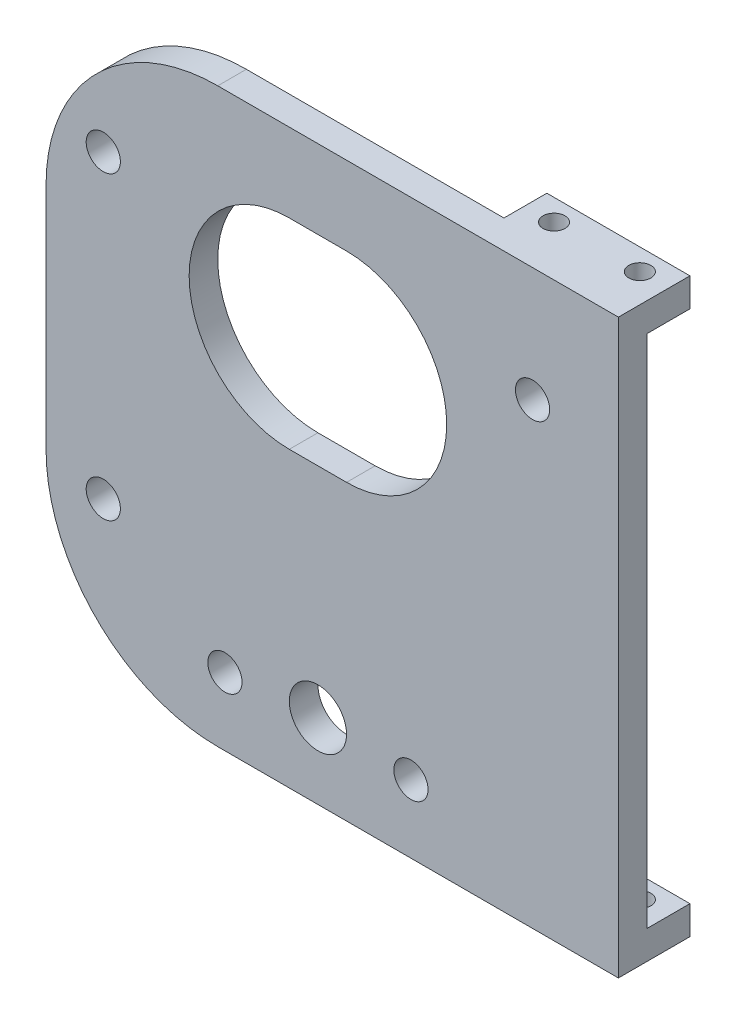
ISO-10303-21;
HEADER;
FILE_DESCRIPTION(('STEP AP214'),'2;1');
FILE_NAME('part.step','',(''),(''),'','','');
FILE_SCHEMA(('AUTOMOTIVE_DESIGN { 1 0 10303 214 1 1 1 1 }'));
ENDSEC;
DATA;
#1=APPLICATION_CONTEXT('core data for automotive mechanical design processes');
#2=APPLICATION_PROTOCOL_DEFINITION('international standard','automotive_design',2000,#1);
#3=PRODUCT_CONTEXT('',#1,'mechanical');
#4=PRODUCT('Part','Part','',(#3));
#5=PRODUCT_RELATED_PRODUCT_CATEGORY('part','',(#4));
#6=PRODUCT_DEFINITION_FORMATION('','',#4);
#7=PRODUCT_DEFINITION_CONTEXT('part definition',#1,'design');
#8=PRODUCT_DEFINITION('design','',#6,#7);
#9=PRODUCT_DEFINITION_SHAPE('','',#8);
#10=(LENGTH_UNIT() NAMED_UNIT(*) SI_UNIT(.MILLI.,.METRE.));
#11=(NAMED_UNIT(*) PLANE_ANGLE_UNIT() SI_UNIT($,.RADIAN.));
#12=(NAMED_UNIT(*) SI_UNIT($,.STERADIAN.) SOLID_ANGLE_UNIT());
#13=UNCERTAINTY_MEASURE_WITH_UNIT(LENGTH_MEASURE(1.E-05),#10,'distance_accuracy_value','');
#14=(GEOMETRIC_REPRESENTATION_CONTEXT(3) GLOBAL_UNCERTAINTY_ASSIGNED_CONTEXT((#13)) GLOBAL_UNIT_ASSIGNED_CONTEXT((#10,
#11,#12)) REPRESENTATION_CONTEXT('',''));
#15=CARTESIAN_POINT('',(0.,0.,0.));
#16=DIRECTION('',(0.,0.,1.));
#17=DIRECTION('',(1.,0.,0.));
#18=AXIS2_PLACEMENT_3D('',#15,#16,#17);
#19=CARTESIAN_POINT('',(0.,0.,0.));
#20=DIRECTION('',(0.,0.,1.));
#21=DIRECTION('',(1.,0.,0.));
#22=AXIS2_PLACEMENT_3D('',#19,#20,#21);
#23=PLANE('',#22);
#24=DIRECTION('',(1.,0.,0.));
#25=VECTOR('',#24,1.);
#26=CARTESIAN_POINT('',(-4.76249999999997,23.01875,0.));
#27=LINE('',#26,#25);
#28=CARTESIAN_POINT('',(-4.76249999999997,23.01875,0.));
#29=VERTEX_POINT('',#28);
#30=CARTESIAN_POINT('',(1.58750000000004,23.01875,0.));
#31=VERTEX_POINT('',#30);
#32=EDGE_CURVE('E165',#29,#31,#27,.T.);
#33=ORIENTED_EDGE('',*,*,#32,.F.);
#34=CARTESIAN_POINT('',(-4.76249999999997,11.90625,0.));
#35=DIRECTION('',(0.,0.,1.));
#36=DIRECTION('',(1.,0.,0.));
#37=AXIS2_PLACEMENT_3D('',#34,#35,#36);
#38=CIRCLE('',#37,11.1125);
#39=CARTESIAN_POINT('',(-4.76249999999997,0.79375000000001,0.));
#40=VERTEX_POINT('',#39);
#41=EDGE_CURVE('E148',#40,#29,#38,.F.);
#42=ORIENTED_EDGE('',*,*,#41,.F.);
#43=DIRECTION('',(-1.,0.,0.));
#44=VECTOR('',#43,1.);
#45=CARTESIAN_POINT('',(-4.76249999999997,0.79375000000001,0.));
#46=LINE('',#45,#44);
#47=CARTESIAN_POINT('',(1.58750000000004,0.79375000000001,0.));
#48=VERTEX_POINT('',#47);
#49=EDGE_CURVE('E157',#48,#40,#46,.T.);
#50=ORIENTED_EDGE('',*,*,#49,.F.);
#51=CARTESIAN_POINT('',(1.58750000000004,11.90625,0.));
#52=DIRECTION('',(0.,0.,1.));
#53=DIRECTION('',(1.,0.,0.));
#54=AXIS2_PLACEMENT_3D('',#51,#52,#53);
#55=CIRCLE('',#54,11.1125);
#56=EDGE_CURVE('E49',#31,#48,#55,.F.);
#57=ORIENTED_EDGE('',*,*,#56,.F.);
#58=EDGE_LOOP('',(#33,#42,#50,#57));
#59=FACE_BOUND('',#58,.T.);
#60=CARTESIAN_POINT('',(-1.58749999999996,-23.4156250000001,0.));
#61=DIRECTION('',(0.,0.,1.));
#62=DIRECTION('',(1.,0.,0.));
#63=AXIS2_PLACEMENT_3D('',#60,#61,#62);
#64=CIRCLE('',#63,3.175);
#65=CARTESIAN_POINT('',(1.58750000000004,-23.4156250000001,0.));
#66=VERTEX_POINT('',#65);
#67=EDGE_CURVE('E185',#66,#66,#64,.F.);
#68=ORIENTED_EDGE('',*,*,#67,.F.);
#69=EDGE_LOOP('',(#68));
#70=FACE_BOUND('',#69,.T.);
#71=CARTESIAN_POINT('',(-11.9062499999999,-24.2093750000001,0.));
#72=DIRECTION('',(0.,0.,1.));
#73=DIRECTION('',(1.,0.,0.));
#74=AXIS2_PLACEMENT_3D('',#71,#72,#73);
#75=CIRCLE('',#74,3.175);
#76=CARTESIAN_POINT('',(-8.73124999999989,-24.2093750000001,0.));
#77=VERTEX_POINT('',#76);
#78=EDGE_CURVE('E217',#77,#77,#75,.T.);
#79=ORIENTED_EDGE('',*,*,#78,.T.);
#80=EDGE_LOOP('',(#79));
#81=FACE_BOUND('',#80,.T.);
#82=CARTESIAN_POINT('',(8.73125000000012,-24.209375,0.));
#83=DIRECTION('',(0.,0.,1.));
#84=DIRECTION('',(1.,0.,0.));
#85=AXIS2_PLACEMENT_3D('',#82,#83,#84);
#86=CIRCLE('',#85,3.175);
#87=CARTESIAN_POINT('',(11.9062500000001,-24.209375,0.));
#88=VERTEX_POINT('',#87);
#89=EDGE_CURVE('E221',#88,#88,#86,.T.);
#90=ORIENTED_EDGE('',*,*,#89,.T.);
#91=EDGE_LOOP('',(#90));
#92=FACE_BOUND('',#91,.T.);
#93=CARTESIAN_POINT('',(22.225,19.05,0.));
#94=DIRECTION('',(0.,0.,1.));
#95=DIRECTION('',(1.,0.,0.));
#96=AXIS2_PLACEMENT_3D('',#93,#94,#95);
#97=CIRCLE('',#96,3.175);
#98=CARTESIAN_POINT('',(25.4,19.05,0.));
#99=VERTEX_POINT('',#98);
#100=EDGE_CURVE('E227',#99,#99,#97,.T.);
#101=ORIENTED_EDGE('',*,*,#100,.T.);
#102=EDGE_LOOP('',(#101));
#103=FACE_BOUND('',#102,.T.);
#104=CARTESIAN_POINT('',(-25.3999999999999,-14.2875000000001,0.));
#105=DIRECTION('',(0.,0.,1.));
#106=DIRECTION('',(1.,0.,0.));
#107=AXIS2_PLACEMENT_3D('',#104,#105,#106);
#108=CIRCLE('',#107,3.175);
#109=CARTESIAN_POINT('',(-22.2249999999999,-14.2875000000001,0.));
#110=VERTEX_POINT('',#109);
#111=EDGE_CURVE('E233',#110,#110,#108,.T.);
#112=ORIENTED_EDGE('',*,*,#111,.T.);
#113=EDGE_LOOP('',(#112));
#114=FACE_BOUND('',#113,.T.);
#115=CARTESIAN_POINT('',(-25.4,19.0499999999999,0.));
#116=DIRECTION('',(0.,0.,1.));
#117=DIRECTION('',(1.,0.,0.));
#118=AXIS2_PLACEMENT_3D('',#115,#116,#117);
#119=CIRCLE('',#118,3.175);
#120=CARTESIAN_POINT('',(-22.225,19.0499999999999,0.));
#121=VERTEX_POINT('',#120);
#122=EDGE_CURVE('E239',#121,#121,#119,.T.);
#123=ORIENTED_EDGE('',*,*,#122,.T.);
#124=EDGE_LOOP('',(#123));
#125=FACE_BOUND('',#124,.T.);
#126=DIRECTION('',(-1.,0.,0.));
#127=VECTOR('',#126,1.);
#128=CARTESIAN_POINT('',(31.75,28.575,0.));
#129=LINE('',#128,#127);
#130=CARTESIAN_POINT('',(31.75,28.575,0.));
#131=VERTEX_POINT('',#130);
#132=CARTESIAN_POINT('',(15.875,28.575,0.));
#133=VERTEX_POINT('',#132);
#134=EDGE_CURVE('E259',#131,#133,#129,.T.);
#135=ORIENTED_EDGE('',*,*,#134,.F.);
#136=DIRECTION('',(0.,1.,0.));
#137=VECTOR('',#136,1.);
#138=CARTESIAN_POINT('',(31.75,31.75,0.));
#139=LINE('',#138,#137);
#140=CARTESIAN_POINT('',(31.75,-28.575,0.));
#141=VERTEX_POINT('',#140);
#142=EDGE_CURVE('E318',#141,#131,#139,.T.);
#143=ORIENTED_EDGE('',*,*,#142,.F.);
#144=DIRECTION('',(1.,0.,0.));
#145=VECTOR('',#144,1.);
#146=CARTESIAN_POINT('',(31.75,-28.575,0.));
#147=LINE('',#146,#145);
#148=CARTESIAN_POINT('',(15.875,-28.575,0.));
#149=VERTEX_POINT('',#148);
#150=EDGE_CURVE('E298',#149,#141,#147,.T.);
#151=ORIENTED_EDGE('',*,*,#150,.F.);
#152=DIRECTION('',(0.,1.,0.));
#153=VECTOR('',#152,1.);
#154=CARTESIAN_POINT('',(15.875,-31.75,0.));
#155=LINE('',#154,#153);
#156=CARTESIAN_POINT('',(15.875,-31.75,0.));
#157=VERTEX_POINT('',#156);
#158=EDGE_CURVE('E293',#157,#149,#155,.T.);
#159=ORIENTED_EDGE('',*,*,#158,.F.);
#160=DIRECTION('',(1.,0.,0.));
#161=VECTOR('',#160,1.);
#162=CARTESIAN_POINT('',(-31.75,-31.75,0.));
#163=LINE('',#162,#161);
#164=CARTESIAN_POINT('',(-12.7,-31.75,0.));
#165=VERTEX_POINT('',#164);
#166=EDGE_CURVE('E323',#165,#157,#163,.T.);
#167=ORIENTED_EDGE('',*,*,#166,.F.);
#168=CARTESIAN_POINT('',(-12.7,-12.7,0.));
#169=DIRECTION('',(0.,0.,1.));
#170=DIRECTION('',(1.,0.,0.));
#171=AXIS2_PLACEMENT_3D('',#168,#169,#170);
#172=CIRCLE('',#171,19.05);
#173=CARTESIAN_POINT('',(-31.75,-12.7,0.));
#174=VERTEX_POINT('',#173);
#175=EDGE_CURVE('E349',#165,#174,#172,.F.);
#176=ORIENTED_EDGE('',*,*,#175,.T.);
#177=DIRECTION('',(0.,-1.,0.));
#178=VECTOR('',#177,1.);
#179=CARTESIAN_POINT('',(-31.75,31.75,0.));
#180=LINE('',#179,#178);
#181=CARTESIAN_POINT('',(-31.75,12.7,0.));
#182=VERTEX_POINT('',#181);
#183=EDGE_CURVE('E336',#182,#174,#180,.T.);
#184=ORIENTED_EDGE('',*,*,#183,.F.);
#185=CARTESIAN_POINT('',(-12.7,12.7,0.));
#186=DIRECTION('',(0.,0.,1.));
#187=DIRECTION('',(1.,0.,0.));
#188=AXIS2_PLACEMENT_3D('',#185,#186,#187);
#189=CIRCLE('',#188,19.05);
#190=CARTESIAN_POINT('',(-12.7,31.75,0.));
#191=VERTEX_POINT('',#190);
#192=EDGE_CURVE('E346',#182,#191,#189,.F.);
#193=ORIENTED_EDGE('',*,*,#192,.T.);
#194=DIRECTION('',(-1.,0.,0.));
#195=VECTOR('',#194,1.);
#196=CARTESIAN_POINT('',(-31.75,31.75,0.));
#197=LINE('',#196,#195);
#198=CARTESIAN_POINT('',(15.875,31.75,0.));
#199=VERTEX_POINT('',#198);
#200=EDGE_CURVE('E334',#199,#191,#197,.T.);
#201=ORIENTED_EDGE('',*,*,#200,.F.);
#202=DIRECTION('',(0.,1.,0.));
#203=VECTOR('',#202,1.);
#204=CARTESIAN_POINT('',(15.875,31.75,0.));
#205=LINE('',#204,#203);
#206=EDGE_CURVE('E264',#133,#199,#205,.T.);
#207=ORIENTED_EDGE('',*,*,#206,.F.);
#208=EDGE_LOOP('',(#135,#143,#151,#159,#167,#176,#184,#193,#201,#207));
#209=FACE_BOUND('',#208,.T.);
#210=ADVANCED_FACE('F34',(#59,#70,#81,#92,#103,#114,#125,#209),#23,.F.);
#211=CARTESIAN_POINT('',(31.75,31.75,3.175));
#212=DIRECTION('',(-1.,0.,0.));
#213=DIRECTION('',(0.,0.,1.));
#214=AXIS2_PLACEMENT_3D('',#211,#212,#213);
#215=PLANE('',#214);
#216=DIRECTION('',(0.,0.,-1.));
#217=VECTOR('',#216,1.);
#218=CARTESIAN_POINT('',(31.75,-31.75,3.175));
#219=LINE('',#218,#217);
#220=CARTESIAN_POINT('',(31.75,-31.75,3.175));
#221=VERTEX_POINT('',#220);
#222=CARTESIAN_POINT('',(31.75,-31.75,-4.7625));
#223=VERTEX_POINT('',#222);
#224=EDGE_CURVE('E331',#221,#223,#219,.T.);
#225=ORIENTED_EDGE('',*,*,#224,.T.);
#226=DIRECTION('',(0.,-1.,0.));
#227=VECTOR('',#226,1.);
#228=CARTESIAN_POINT('',(31.75,-31.75,-4.7625));
#229=LINE('',#228,#227);
#230=CARTESIAN_POINT('',(31.75,-28.575,-4.7625));
#231=VERTEX_POINT('',#230);
#232=EDGE_CURVE('E300',#231,#223,#229,.T.);
#233=ORIENTED_EDGE('',*,*,#232,.F.);
#234=DIRECTION('',(0.,0.,1.));
#235=VECTOR('',#234,1.);
#236=CARTESIAN_POINT('',(31.75,-28.575,-4.7625));
#237=LINE('',#236,#235);
#238=EDGE_CURVE('E312',#231,#141,#237,.T.);
#239=ORIENTED_EDGE('',*,*,#238,.T.);
#240=ORIENTED_EDGE('',*,*,#142,.T.);
#241=DIRECTION('',(0.,0.,1.));
#242=VECTOR('',#241,1.);
#243=CARTESIAN_POINT('',(31.75,28.575,-4.7625));
#244=LINE('',#243,#242);
#245=CARTESIAN_POINT('',(31.75,28.575,-4.7625));
#246=VERTEX_POINT('',#245);
#247=EDGE_CURVE('E279',#246,#131,#244,.T.);
#248=ORIENTED_EDGE('',*,*,#247,.F.);
#249=DIRECTION('',(0.,-1.,0.));
#250=VECTOR('',#249,1.);
#251=CARTESIAN_POINT('',(31.75,31.75,-4.7625));
#252=LINE('',#251,#250);
#253=CARTESIAN_POINT('',(31.75,31.75,-4.7625));
#254=VERTEX_POINT('',#253);
#255=EDGE_CURVE('E260',#254,#246,#252,.T.);
#256=ORIENTED_EDGE('',*,*,#255,.F.);
#257=DIRECTION('',(0.,0.,-1.));
#258=VECTOR('',#257,1.);
#259=CARTESIAN_POINT('',(31.75,31.75,3.175));
#260=LINE('',#259,#258);
#261=CARTESIAN_POINT('',(31.75,31.75,3.175));
#262=VERTEX_POINT('',#261);
#263=EDGE_CURVE('E341',#262,#254,#260,.T.);
#264=ORIENTED_EDGE('',*,*,#263,.F.);
#265=DIRECTION('',(0.,1.,0.));
#266=VECTOR('',#265,1.);
#267=CARTESIAN_POINT('',(31.75,31.75,3.175));
#268=LINE('',#267,#266);
#269=EDGE_CURVE('E319',#221,#262,#268,.T.);
#270=ORIENTED_EDGE('',*,*,#269,.F.);
#271=EDGE_LOOP('',(#225,#233,#239,#240,#248,#256,#264,#270));
#272=FACE_BOUND('',#271,.T.);
#273=ADVANCED_FACE('F396',(#272),#215,.F.);
#274=CARTESIAN_POINT('',(-31.75,31.75,3.175));
#275=DIRECTION('',(0.,-1.,0.));
#276=DIRECTION('',(0.,0.,-1.));
#277=AXIS2_PLACEMENT_3D('',#274,#275,#276);
#278=PLANE('',#277);
#279=CARTESIAN_POINT('',(19.05,31.75,-2.38125));
#280=DIRECTION('',(0.,-1.,0.));
#281=DIRECTION('',(0.,0.,-1.));
#282=AXIS2_PLACEMENT_3D('',#279,#280,#281);
#283=CIRCLE('',#282,1.21919999999999);
#284=CARTESIAN_POINT('',(19.05,31.75,-3.60044999999999));
#285=VERTEX_POINT('',#284);
#286=EDGE_CURVE('E250',#285,#285,#283,.T.);
#287=ORIENTED_EDGE('',*,*,#286,.T.);
#288=EDGE_LOOP('',(#287));
#289=FACE_BOUND('',#288,.T.);
#290=CARTESIAN_POINT('',(28.575,31.75,-2.38125));
#291=DIRECTION('',(0.,-1.,0.));
#292=DIRECTION('',(0.,0.,-1.));
#293=AXIS2_PLACEMENT_3D('',#290,#291,#292);
#294=CIRCLE('',#293,1.21919999999999);
#295=CARTESIAN_POINT('',(28.575,31.75,-3.60044999999999));
#296=VERTEX_POINT('',#295);
#297=EDGE_CURVE('E256',#296,#296,#294,.T.);
#298=ORIENTED_EDGE('',*,*,#297,.T.);
#299=EDGE_LOOP('',(#298));
#300=FACE_BOUND('',#299,.T.);
#301=ORIENTED_EDGE('',*,*,#263,.T.);
#302=DIRECTION('',(1.,0.,0.));
#303=VECTOR('',#302,1.);
#304=CARTESIAN_POINT('',(31.75,31.75,-4.7625));
#305=LINE('',#304,#303);
#306=CARTESIAN_POINT('',(15.875,31.75,-4.7625));
#307=VERTEX_POINT('',#306);
#308=EDGE_CURVE('E268',#307,#254,#305,.T.);
#309=ORIENTED_EDGE('',*,*,#308,.F.);
#310=DIRECTION('',(0.,0.,1.));
#311=VECTOR('',#310,1.);
#312=CARTESIAN_POINT('',(15.875,31.75,-4.7625));
#313=LINE('',#312,#311);
#314=EDGE_CURVE('E271',#307,#199,#313,.T.);
#315=ORIENTED_EDGE('',*,*,#314,.T.);
#316=ORIENTED_EDGE('',*,*,#200,.T.);
#317=DIRECTION('',(0.,0.,-1.));
#318=VECTOR('',#317,1.);
#319=CARTESIAN_POINT('',(-12.7,31.75,3.175));
#320=LINE('',#319,#318);
#321=CARTESIAN_POINT('',(-12.7,31.75,3.175));
#322=VERTEX_POINT('',#321);
#323=EDGE_CURVE('E11',#191,#322,#320,.F.);
#324=ORIENTED_EDGE('',*,*,#323,.T.);
#325=DIRECTION('',(-1.,0.,0.));
#326=VECTOR('',#325,1.);
#327=CARTESIAN_POINT('',(-31.75,31.75,3.175));
#328=LINE('',#327,#326);
#329=EDGE_CURVE('E322',#262,#322,#328,.T.);
#330=ORIENTED_EDGE('',*,*,#329,.F.);
#331=EDGE_LOOP('',(#301,#309,#315,#316,#324,#330));
#332=FACE_BOUND('',#331,.T.);
#333=ADVANCED_FACE('F385',(#289,#300,#332),#278,.F.);
#334=CARTESIAN_POINT('',(-31.75,31.75,3.175));
#335=DIRECTION('',(1.,0.,0.));
#336=DIRECTION('',(0.,0.,-1.));
#337=AXIS2_PLACEMENT_3D('',#334,#335,#336);
#338=PLANE('',#337);
#339=ORIENTED_EDGE('',*,*,#183,.T.);
#340=DIRECTION('',(0.,0.,-1.));
#341=VECTOR('',#340,1.);
#342=CARTESIAN_POINT('',(-31.75,-12.7,3.175));
#343=LINE('',#342,#341);
#344=CARTESIAN_POINT('',(-31.75,-12.7,3.175));
#345=VERTEX_POINT('',#344);
#346=EDGE_CURVE('E354',#174,#345,#343,.F.);
#347=ORIENTED_EDGE('',*,*,#346,.T.);
#348=DIRECTION('',(0.,-1.,0.));
#349=VECTOR('',#348,1.);
#350=CARTESIAN_POINT('',(-31.75,31.75,3.175));
#351=LINE('',#350,#349);
#352=CARTESIAN_POINT('',(-31.75,12.7,3.175));
#353=VERTEX_POINT('',#352);
#354=EDGE_CURVE('E326',#353,#345,#351,.T.);
#355=ORIENTED_EDGE('',*,*,#354,.F.);
#356=DIRECTION('',(0.,0.,-1.));
#357=VECTOR('',#356,1.);
#358=CARTESIAN_POINT('',(-31.75,12.7,3.175));
#359=LINE('',#358,#357);
#360=EDGE_CURVE('E351',#353,#182,#359,.T.);
#361=ORIENTED_EDGE('',*,*,#360,.T.);
#362=EDGE_LOOP('',(#339,#347,#355,#361));
#363=FACE_BOUND('',#362,.T.);
#364=ADVANCED_FACE('F377',(#363),#338,.F.);
#365=CARTESIAN_POINT('',(-31.75,-31.75,3.175));
#366=DIRECTION('',(0.,1.,0.));
#367=DIRECTION('',(0.,0.,1.));
#368=AXIS2_PLACEMENT_3D('',#365,#366,#367);
#369=PLANE('',#368);
#370=CARTESIAN_POINT('',(28.575,-31.75,-2.38125));
#371=DIRECTION('',(0.,1.,0.));
#372=DIRECTION('',(0.,0.,1.));
#373=AXIS2_PLACEMENT_3D('',#370,#371,#372);
#374=CIRCLE('',#373,1.21919999999999);
#375=CARTESIAN_POINT('',(28.575,-31.75,-1.16205000000001));
#376=VERTEX_POINT('',#375);
#377=EDGE_CURVE('E284',#376,#376,#374,.T.);
#378=ORIENTED_EDGE('',*,*,#377,.T.);
#379=EDGE_LOOP('',(#378));
#380=FACE_BOUND('',#379,.T.);
#381=CARTESIAN_POINT('',(19.05,-31.75,-2.38125));
#382=DIRECTION('',(0.,1.,0.));
#383=DIRECTION('',(0.,0.,1.));
#384=AXIS2_PLACEMENT_3D('',#381,#382,#383);
#385=CIRCLE('',#384,1.21919999999999);
#386=CARTESIAN_POINT('',(19.05,-31.75,-1.16205000000001));
#387=VERTEX_POINT('',#386);
#388=EDGE_CURVE('E290',#387,#387,#385,.T.);
#389=ORIENTED_EDGE('',*,*,#388,.T.);
#390=EDGE_LOOP('',(#389));
#391=FACE_BOUND('',#390,.T.);
#392=DIRECTION('',(1.,0.,0.));
#393=VECTOR('',#392,1.);
#394=CARTESIAN_POINT('',(-31.75,-31.75,3.175));
#395=LINE('',#394,#393);
#396=CARTESIAN_POINT('',(-12.7,-31.75,3.175));
#397=VERTEX_POINT('',#396);
#398=EDGE_CURVE('E329',#397,#221,#395,.T.);
#399=ORIENTED_EDGE('',*,*,#398,.F.);
#400=DIRECTION('',(0.,0.,-1.));
#401=VECTOR('',#400,1.);
#402=CARTESIAN_POINT('',(-12.7,-31.75,3.175));
#403=LINE('',#402,#401);
#404=EDGE_CURVE('E343',#397,#165,#403,.T.);
#405=ORIENTED_EDGE('',*,*,#404,.T.);
#406=ORIENTED_EDGE('',*,*,#166,.T.);
#407=DIRECTION('',(0.,0.,1.));
#408=VECTOR('',#407,1.);
#409=CARTESIAN_POINT('',(15.875,-31.75,-4.7625));
#410=LINE('',#409,#408);
#411=CARTESIAN_POINT('',(15.875,-31.75,-4.7625));
#412=VERTEX_POINT('',#411);
#413=EDGE_CURVE('E305',#412,#157,#410,.T.);
#414=ORIENTED_EDGE('',*,*,#413,.F.);
#415=DIRECTION('',(-1.,0.,0.));
#416=VECTOR('',#415,1.);
#417=CARTESIAN_POINT('',(31.75,-31.75,-4.7625));
#418=LINE('',#417,#416);
#419=EDGE_CURVE('E303',#223,#412,#418,.T.);
#420=ORIENTED_EDGE('',*,*,#419,.F.);
#421=ORIENTED_EDGE('',*,*,#224,.F.);
#422=EDGE_LOOP('',(#399,#405,#406,#414,#420,#421));
#423=FACE_BOUND('',#422,.T.);
#424=ADVANCED_FACE('F367',(#380,#391,#423),#369,.F.);
#425=CARTESIAN_POINT('',(0.,0.,3.175));
#426=DIRECTION('',(0.,0.,1.));
#427=DIRECTION('',(1.,0.,0.));
#428=AXIS2_PLACEMENT_3D('',#425,#426,#427);
#429=PLANE('',#428);
#430=CARTESIAN_POINT('',(-4.76249999999997,11.90625,3.175));
#431=DIRECTION('',(0.,0.,1.));
#432=DIRECTION('',(1.,0.,0.));
#433=AXIS2_PLACEMENT_3D('',#430,#431,#432);
#434=CIRCLE('',#433,11.1125);
#435=CARTESIAN_POINT('',(-4.76249999999997,23.01875,3.175));
#436=VERTEX_POINT('',#435);
#437=CARTESIAN_POINT('',(-4.76249999999997,0.79375000000001,3.175));
#438=VERTEX_POINT('',#437);
#439=EDGE_CURVE('E57',#436,#438,#434,.T.);
#440=ORIENTED_EDGE('',*,*,#439,.F.);
#441=DIRECTION('',(-1.,0.,0.));
#442=VECTOR('',#441,1.);
#443=CARTESIAN_POINT('',(-4.76249999999997,23.01875,3.175));
#444=LINE('',#443,#442);
#445=CARTESIAN_POINT('',(1.58750000000004,23.01875,3.175));
#446=VERTEX_POINT('',#445);
#447=EDGE_CURVE('E154',#446,#436,#444,.T.);
#448=ORIENTED_EDGE('',*,*,#447,.F.);
#449=CARTESIAN_POINT('',(1.58750000000004,11.90625,3.175));
#450=DIRECTION('',(0.,0.,1.));
#451=DIRECTION('',(1.,0.,0.));
#452=AXIS2_PLACEMENT_3D('',#449,#450,#451);
#453=CIRCLE('',#452,11.1125);
#454=CARTESIAN_POINT('',(1.58750000000004,0.79375000000001,3.175));
#455=VERTEX_POINT('',#454);
#456=EDGE_CURVE('E173',#455,#446,#453,.T.);
#457=ORIENTED_EDGE('',*,*,#456,.F.);
#458=DIRECTION('',(1.,0.,0.));
#459=VECTOR('',#458,1.);
#460=CARTESIAN_POINT('',(-4.76249999999997,0.79375000000001,3.175));
#461=LINE('',#460,#459);
#462=EDGE_CURVE('E167',#438,#455,#461,.T.);
#463=ORIENTED_EDGE('',*,*,#462,.F.);
#464=EDGE_LOOP('',(#440,#448,#457,#463));
#465=FACE_BOUND('',#464,.T.);
#466=CARTESIAN_POINT('',(-1.58749999999996,-23.4156250000001,3.175));
#467=DIRECTION('',(0.,0.,1.));
#468=DIRECTION('',(1.,0.,0.));
#469=AXIS2_PLACEMENT_3D('',#466,#467,#468);
#470=CIRCLE('',#469,3.175);
#471=CARTESIAN_POINT('',(1.58750000000004,-23.4156250000001,3.175));
#472=VERTEX_POINT('',#471);
#473=EDGE_CURVE('E182',#472,#472,#470,.T.);
#474=ORIENTED_EDGE('',*,*,#473,.F.);
#475=EDGE_LOOP('',(#474));
#476=FACE_BOUND('',#475,.T.);
#477=CARTESIAN_POINT('',(22.225,19.05,3.17499999999999));
#478=DIRECTION('',(0.,0.,-1.));
#479=DIRECTION('',(-1.,0.,0.));
#480=AXIS2_PLACEMENT_3D('',#477,#478,#479);
#481=CIRCLE('',#480,1.89864999999999);
#482=CARTESIAN_POINT('',(20.3263500000001,19.05,3.17499999999999));
#483=VERTEX_POINT('',#482);
#484=EDGE_CURVE('E190',#483,#483,#481,.T.);
#485=ORIENTED_EDGE('',*,*,#484,.T.);
#486=EDGE_LOOP('',(#485));
#487=FACE_BOUND('',#486,.T.);
#488=CARTESIAN_POINT('',(-25.4,19.0499999999999,3.17499999999999));
#489=DIRECTION('',(0.,0.,-1.));
#490=DIRECTION('',(-1.,0.,0.));
#491=AXIS2_PLACEMENT_3D('',#488,#489,#490);
#492=CIRCLE('',#491,1.89864999999999);
#493=CARTESIAN_POINT('',(-27.29865,19.0499999999999,3.17499999999999));
#494=VERTEX_POINT('',#493);
#495=EDGE_CURVE('E196',#494,#494,#492,.T.);
#496=ORIENTED_EDGE('',*,*,#495,.T.);
#497=EDGE_LOOP('',(#496));
#498=FACE_BOUND('',#497,.T.);
#499=CARTESIAN_POINT('',(-25.3999999999999,-14.2875000000001,3.17499999999999));
#500=DIRECTION('',(0.,0.,-1.));
#501=DIRECTION('',(-1.,0.,0.));
#502=AXIS2_PLACEMENT_3D('',#499,#500,#501);
#503=CIRCLE('',#502,1.89864999999999);
#504=CARTESIAN_POINT('',(-27.2986499999999,-14.2875000000001,3.17499999999999));
#505=VERTEX_POINT('',#504);
#506=EDGE_CURVE('E202',#505,#505,#503,.T.);
#507=ORIENTED_EDGE('',*,*,#506,.T.);
#508=EDGE_LOOP('',(#507));
#509=FACE_BOUND('',#508,.T.);
#510=CARTESIAN_POINT('',(-11.9062499999999,-24.2093750000001,3.17499999999999));
#511=DIRECTION('',(0.,0.,-1.));
#512=DIRECTION('',(-1.,0.,0.));
#513=AXIS2_PLACEMENT_3D('',#510,#511,#512);
#514=CIRCLE('',#513,1.89864999999999);
#515=CARTESIAN_POINT('',(-13.8048999999999,-24.2093750000001,3.17499999999999));
#516=VERTEX_POINT('',#515);
#517=EDGE_CURVE('E208',#516,#516,#514,.T.);
#518=ORIENTED_EDGE('',*,*,#517,.T.);
#519=EDGE_LOOP('',(#518));
#520=FACE_BOUND('',#519,.T.);
#521=CARTESIAN_POINT('',(8.73125000000012,-24.209375,3.17499999999999));
#522=DIRECTION('',(0.,0.,-1.));
#523=DIRECTION('',(-1.,0.,0.));
#524=AXIS2_PLACEMENT_3D('',#521,#522,#523);
#525=CIRCLE('',#524,1.89864999999999);
#526=CARTESIAN_POINT('',(6.83260000000013,-24.209375,3.17499999999999));
#527=VERTEX_POINT('',#526);
#528=EDGE_CURVE('E214',#527,#527,#525,.T.);
#529=ORIENTED_EDGE('',*,*,#528,.T.);
#530=EDGE_LOOP('',(#529));
#531=FACE_BOUND('',#530,.T.);
#532=ORIENTED_EDGE('',*,*,#354,.T.);
#533=CARTESIAN_POINT('',(-12.7,-12.7,3.175));
#534=DIRECTION('',(0.,0.,1.));
#535=DIRECTION('',(1.,0.,0.));
#536=AXIS2_PLACEMENT_3D('',#533,#534,#535);
#537=CIRCLE('',#536,19.05);
#538=EDGE_CURVE('E42',#345,#397,#537,.T.);
#539=ORIENTED_EDGE('',*,*,#538,.T.);
#540=ORIENTED_EDGE('',*,*,#398,.T.);
#541=ORIENTED_EDGE('',*,*,#269,.T.);
#542=ORIENTED_EDGE('',*,*,#329,.T.);
#543=CARTESIAN_POINT('',(-12.7,12.7,3.175));
#544=DIRECTION('',(0.,0.,1.));
#545=DIRECTION('',(1.,0.,0.));
#546=AXIS2_PLACEMENT_3D('',#543,#544,#545);
#547=CIRCLE('',#546,19.05);
#548=EDGE_CURVE('E356',#322,#353,#547,.T.);
#549=ORIENTED_EDGE('',*,*,#548,.T.);
#550=EDGE_LOOP('',(#532,#539,#540,#541,#542,#549));
#551=FACE_BOUND('',#550,.T.);
#552=ADVANCED_FACE('F360',(#465,#476,#487,#498,#509,#520,#531,#551),#429,.T.);
#553=CARTESIAN_POINT('',(15.875,-31.75,-4.7625));
#554=DIRECTION('',(1.,0.,0.));
#555=DIRECTION('',(0.,0.,-1.));
#556=AXIS2_PLACEMENT_3D('',#553,#554,#555);
#557=PLANE('',#556);
#558=ORIENTED_EDGE('',*,*,#158,.T.);
#559=DIRECTION('',(0.,0.,1.));
#560=VECTOR('',#559,1.);
#561=CARTESIAN_POINT('',(15.875,-28.575,-4.7625));
#562=LINE('',#561,#560);
#563=CARTESIAN_POINT('',(15.875,-28.575,-4.7625));
#564=VERTEX_POINT('',#563);
#565=EDGE_CURVE('E315',#564,#149,#562,.T.);
#566=ORIENTED_EDGE('',*,*,#565,.F.);
#567=DIRECTION('',(0.,1.,0.));
#568=VECTOR('',#567,1.);
#569=CARTESIAN_POINT('',(15.875,-31.75,-4.7625));
#570=LINE('',#569,#568);
#571=EDGE_CURVE('E294',#412,#564,#570,.T.);
#572=ORIENTED_EDGE('',*,*,#571,.F.);
#573=ORIENTED_EDGE('',*,*,#413,.T.);
#574=EDGE_LOOP('',(#558,#566,#572,#573));
#575=FACE_BOUND('',#574,.T.);
#576=ADVANCED_FACE('F406',(#575),#557,.F.);
#577=CARTESIAN_POINT('',(31.75,-28.575,-4.7625));
#578=DIRECTION('',(0.,-1.,0.));
#579=DIRECTION('',(0.,0.,-1.));
#580=AXIS2_PLACEMENT_3D('',#577,#578,#579);
#581=PLANE('',#580);
#582=CARTESIAN_POINT('',(28.575,-28.575,-2.38125));
#583=DIRECTION('',(0.,1.,0.));
#584=DIRECTION('',(0.,0.,1.));
#585=AXIS2_PLACEMENT_3D('',#582,#583,#584);
#586=CIRCLE('',#585,1.21919999999999);
#587=CARTESIAN_POINT('',(28.575,-28.575,-1.16205000000001));
#588=VERTEX_POINT('',#587);
#589=EDGE_CURVE('E281',#588,#588,#586,.T.);
#590=ORIENTED_EDGE('',*,*,#589,.F.);
#591=EDGE_LOOP('',(#590));
#592=FACE_BOUND('',#591,.T.);
#593=CARTESIAN_POINT('',(19.05,-28.575,-2.38125));
#594=DIRECTION('',(0.,1.,0.));
#595=DIRECTION('',(0.,0.,1.));
#596=AXIS2_PLACEMENT_3D('',#593,#594,#595);
#597=CIRCLE('',#596,1.21919999999999);
#598=CARTESIAN_POINT('',(19.05,-28.575,-1.16205000000001));
#599=VERTEX_POINT('',#598);
#600=EDGE_CURVE('E287',#599,#599,#597,.T.);
#601=ORIENTED_EDGE('',*,*,#600,.F.);
#602=EDGE_LOOP('',(#601));
#603=FACE_BOUND('',#602,.T.);
#604=ORIENTED_EDGE('',*,*,#150,.T.);
#605=ORIENTED_EDGE('',*,*,#238,.F.);
#606=DIRECTION('',(1.,0.,0.));
#607=VECTOR('',#606,1.);
#608=CARTESIAN_POINT('',(25.4,-28.575,-4.7625));
#609=LINE('',#608,#607);
#610=EDGE_CURVE('E297',#564,#231,#609,.T.);
#611=ORIENTED_EDGE('',*,*,#610,.F.);
#612=ORIENTED_EDGE('',*,*,#565,.T.);
#613=EDGE_LOOP('',(#604,#605,#611,#612));
#614=FACE_BOUND('',#613,.T.);
#615=ADVANCED_FACE('F401',(#592,#603,#614),#581,.F.);
#616=CARTESIAN_POINT('',(0.,0.,-4.7625));
#617=DIRECTION('',(0.,0.,1.));
#618=DIRECTION('',(1.,0.,0.));
#619=AXIS2_PLACEMENT_3D('',#616,#617,#618);
#620=PLANE('',#619);
#621=ORIENTED_EDGE('',*,*,#571,.T.);
#622=ORIENTED_EDGE('',*,*,#610,.T.);
#623=ORIENTED_EDGE('',*,*,#232,.T.);
#624=ORIENTED_EDGE('',*,*,#419,.T.);
#625=EDGE_LOOP('',(#621,#622,#623,#624));
#626=FACE_BOUND('',#625,.T.);
#627=ADVANCED_FACE('F408',(#626),#620,.F.);
#628=CARTESIAN_POINT('',(19.05,-28.575,-2.38125));
#629=DIRECTION('',(0.,1.,0.));
#630=DIRECTION('',(0.,0.,1.));
#631=AXIS2_PLACEMENT_3D('',#628,#629,#630);
#632=CYLINDRICAL_SURFACE('',#631,1.21919999999999);
#633=ORIENTED_EDGE('',*,*,#388,.F.);
#634=EDGE_LOOP('',(#633));
#635=FACE_BOUND('',#634,.T.);
#636=ORIENTED_EDGE('',*,*,#600,.T.);
#637=EDGE_LOOP('',(#636));
#638=FACE_BOUND('',#637,.T.);
#639=ADVANCED_FACE('F410',(#635,#638),#632,.F.);
#640=CARTESIAN_POINT('',(28.575,-28.575,-2.38125));
#641=DIRECTION('',(0.,1.,0.));
#642=DIRECTION('',(0.,0.,1.));
#643=AXIS2_PLACEMENT_3D('',#640,#641,#642);
#644=CYLINDRICAL_SURFACE('',#643,1.21919999999999);
#645=ORIENTED_EDGE('',*,*,#377,.F.);
#646=EDGE_LOOP('',(#645));
#647=FACE_BOUND('',#646,.T.);
#648=ORIENTED_EDGE('',*,*,#589,.T.);
#649=EDGE_LOOP('',(#648));
#650=FACE_BOUND('',#649,.T.);
#651=ADVANCED_FACE('F416',(#647,#650),#644,.F.);
#652=CARTESIAN_POINT('',(-12.7,-12.7,3.175));
#653=DIRECTION('',(0.,0.,-1.));
#654=DIRECTION('',(-1.,0.,0.));
#655=AXIS2_PLACEMENT_3D('',#652,#653,#654);
#656=CYLINDRICAL_SURFACE('',#655,19.05);
#657=ORIENTED_EDGE('',*,*,#538,.F.);
#658=ORIENTED_EDGE('',*,*,#346,.F.);
#659=ORIENTED_EDGE('',*,*,#175,.F.);
#660=ORIENTED_EDGE('',*,*,#404,.F.);
#661=EDGE_LOOP('',(#657,#658,#659,#660));
#662=FACE_BOUND('',#661,.T.);
#663=ADVANCED_FACE('F371',(#662),#656,.T.);
#664=CARTESIAN_POINT('',(-12.7,12.7,3.175));
#665=DIRECTION('',(0.,0.,-1.));
#666=DIRECTION('',(-1.,0.,0.));
#667=AXIS2_PLACEMENT_3D('',#664,#665,#666);
#668=CYLINDRICAL_SURFACE('',#667,19.05);
#669=ORIENTED_EDGE('',*,*,#548,.F.);
#670=ORIENTED_EDGE('',*,*,#323,.F.);
#671=ORIENTED_EDGE('',*,*,#192,.F.);
#672=ORIENTED_EDGE('',*,*,#360,.F.);
#673=EDGE_LOOP('',(#669,#670,#671,#672));
#674=FACE_BOUND('',#673,.T.);
#675=ADVANCED_FACE('F36',(#674),#668,.T.);
#676=CARTESIAN_POINT('',(31.75,28.575,-4.7625));
#677=DIRECTION('',(0.,1.,0.));
#678=DIRECTION('',(0.,0.,1.));
#679=AXIS2_PLACEMENT_3D('',#676,#677,#678);
#680=PLANE('',#679);
#681=CARTESIAN_POINT('',(19.05,28.575,-2.38125));
#682=DIRECTION('',(0.,-1.,0.));
#683=DIRECTION('',(0.,0.,-1.));
#684=AXIS2_PLACEMENT_3D('',#681,#682,#683);
#685=CIRCLE('',#684,1.21919999999999);
#686=CARTESIAN_POINT('',(19.05,28.575,-3.60044999999999));
#687=VERTEX_POINT('',#686);
#688=EDGE_CURVE('E245',#687,#687,#685,.T.);
#689=ORIENTED_EDGE('',*,*,#688,.F.);
#690=EDGE_LOOP('',(#689));
#691=FACE_BOUND('',#690,.T.);
#692=CARTESIAN_POINT('',(28.575,28.575,-2.38125));
#693=DIRECTION('',(0.,-1.,0.));
#694=DIRECTION('',(0.,0.,-1.));
#695=AXIS2_PLACEMENT_3D('',#692,#693,#694);
#696=CIRCLE('',#695,1.21919999999999);
#697=CARTESIAN_POINT('',(28.575,28.575,-3.60044999999999));
#698=VERTEX_POINT('',#697);
#699=EDGE_CURVE('E253',#698,#698,#696,.T.);
#700=ORIENTED_EDGE('',*,*,#699,.F.);
#701=EDGE_LOOP('',(#700));
#702=FACE_BOUND('',#701,.T.);
#703=ORIENTED_EDGE('',*,*,#134,.T.);
#704=DIRECTION('',(0.,0.,1.));
#705=VECTOR('',#704,1.);
#706=CARTESIAN_POINT('',(15.875,28.575,-4.7625));
#707=LINE('',#706,#705);
#708=CARTESIAN_POINT('',(15.875,28.575,-4.7625));
#709=VERTEX_POINT('',#708);
#710=EDGE_CURVE('E276',#709,#133,#707,.T.);
#711=ORIENTED_EDGE('',*,*,#710,.F.);
#712=DIRECTION('',(-1.,0.,0.));
#713=VECTOR('',#712,1.);
#714=CARTESIAN_POINT('',(31.75,28.575,-4.7625));
#715=LINE('',#714,#713);
#716=EDGE_CURVE('E263',#246,#709,#715,.T.);
#717=ORIENTED_EDGE('',*,*,#716,.F.);
#718=ORIENTED_EDGE('',*,*,#247,.T.);
#719=EDGE_LOOP('',(#703,#711,#717,#718));
#720=FACE_BOUND('',#719,.T.);
#721=ADVANCED_FACE('F393',(#691,#702,#720),#680,.F.);
#722=CARTESIAN_POINT('',(15.875,31.75,-4.7625));
#723=DIRECTION('',(1.,0.,0.));
#724=DIRECTION('',(0.,0.,-1.));
#725=AXIS2_PLACEMENT_3D('',#722,#723,#724);
#726=PLANE('',#725);
#727=ORIENTED_EDGE('',*,*,#206,.T.);
#728=ORIENTED_EDGE('',*,*,#314,.F.);
#729=DIRECTION('',(0.,1.,0.));
#730=VECTOR('',#729,1.);
#731=CARTESIAN_POINT('',(15.875,31.75,-4.7625));
#732=LINE('',#731,#730);
#733=EDGE_CURVE('E266',#709,#307,#732,.T.);
#734=ORIENTED_EDGE('',*,*,#733,.F.);
#735=ORIENTED_EDGE('',*,*,#710,.T.);
#736=EDGE_LOOP('',(#727,#728,#734,#735));
#737=FACE_BOUND('',#736,.T.);
#738=ADVANCED_FACE('F390',(#737),#726,.F.);
#739=CARTESIAN_POINT('',(0.,0.,-4.7625));
#740=DIRECTION('',(0.,0.,-1.));
#741=DIRECTION('',(-1.,0.,0.));
#742=AXIS2_PLACEMENT_3D('',#739,#740,#741);
#743=PLANE('',#742);
#744=ORIENTED_EDGE('',*,*,#255,.T.);
#745=ORIENTED_EDGE('',*,*,#716,.T.);
#746=ORIENTED_EDGE('',*,*,#733,.T.);
#747=ORIENTED_EDGE('',*,*,#308,.T.);
#748=EDGE_LOOP('',(#744,#745,#746,#747));
#749=FACE_BOUND('',#748,.T.);
#750=ADVANCED_FACE('F454',(#749),#743,.T.);
#751=CARTESIAN_POINT('',(28.575,28.575,-2.38125));
#752=DIRECTION('',(0.,-1.,0.));
#753=DIRECTION('',(0.,0.,-1.));
#754=AXIS2_PLACEMENT_3D('',#751,#752,#753);
#755=CYLINDRICAL_SURFACE('',#754,1.21919999999999);
#756=ORIENTED_EDGE('',*,*,#297,.F.);
#757=EDGE_LOOP('',(#756));
#758=FACE_BOUND('',#757,.T.);
#759=ORIENTED_EDGE('',*,*,#699,.T.);
#760=EDGE_LOOP('',(#759));
#761=FACE_BOUND('',#760,.T.);
#762=ADVANCED_FACE('F457',(#758,#761),#755,.F.);
#763=CARTESIAN_POINT('',(19.05,28.575,-2.38125));
#764=DIRECTION('',(0.,-1.,0.));
#765=DIRECTION('',(0.,0.,-1.));
#766=AXIS2_PLACEMENT_3D('',#763,#764,#765);
#767=CYLINDRICAL_SURFACE('',#766,1.21919999999999);
#768=ORIENTED_EDGE('',*,*,#286,.F.);
#769=EDGE_LOOP('',(#768));
#770=FACE_BOUND('',#769,.T.);
#771=ORIENTED_EDGE('',*,*,#688,.T.);
#772=EDGE_LOOP('',(#771));
#773=FACE_BOUND('',#772,.T.);
#774=ADVANCED_FACE('F461',(#770,#773),#767,.F.);
#775=CARTESIAN_POINT('',(-25.4,19.0499999999999,-3.175));
#776=DIRECTION('',(0.,0.,1.));
#777=DIRECTION('',(1.,0.,0.));
#778=AXIS2_PLACEMENT_3D('',#775,#776,#777);
#779=CYLINDRICAL_SURFACE('',#778,3.175);
#780=CARTESIAN_POINT('',(-25.4,19.0499999999999,-3.175));
#781=DIRECTION('',(0.,0.,1.));
#782=DIRECTION('',(1.,0.,0.));
#783=AXIS2_PLACEMENT_3D('',#780,#781,#782);
#784=CIRCLE('',#783,3.175);
#785=CARTESIAN_POINT('',(-22.225,19.0499999999999,-3.175));
#786=VERTEX_POINT('',#785);
#787=EDGE_CURVE('E242',#786,#786,#784,.T.);
#788=ORIENTED_EDGE('',*,*,#787,.T.);
#789=EDGE_LOOP('',(#788));
#790=FACE_BOUND('',#789,.T.);
#791=ORIENTED_EDGE('',*,*,#122,.F.);
#792=EDGE_LOOP('',(#791));
#793=FACE_BOUND('',#792,.T.);
#794=ADVANCED_FACE('F465',(#790,#793),#779,.T.);
#795=CARTESIAN_POINT('',(-25.4,19.0499999999999,-3.175));
#796=DIRECTION('',(0.,0.,1.));
#797=DIRECTION('',(1.,0.,0.));
#798=AXIS2_PLACEMENT_3D('',#795,#796,#797);
#799=PLANE('',#798);
#800=CARTESIAN_POINT('',(-25.4,19.0499999999999,-3.175));
#801=DIRECTION('',(0.,0.,-1.));
#802=DIRECTION('',(-1.,0.,0.));
#803=AXIS2_PLACEMENT_3D('',#800,#801,#802);
#804=CIRCLE('',#803,1.89864999999999);
#805=CARTESIAN_POINT('',(-27.29865,19.0499999999999,-3.175));
#806=VERTEX_POINT('',#805);
#807=EDGE_CURVE('E193',#806,#806,#804,.T.);
#808=ORIENTED_EDGE('',*,*,#807,.F.);
#809=EDGE_LOOP('',(#808));
#810=FACE_BOUND('',#809,.T.);
#811=ORIENTED_EDGE('',*,*,#787,.F.);
#812=EDGE_LOOP('',(#811));
#813=FACE_BOUND('',#812,.T.);
#814=ADVANCED_FACE('F469',(#810,#813),#799,.F.);
#815=CARTESIAN_POINT('',(-25.3999999999999,-14.2875000000001,-3.175));
#816=DIRECTION('',(0.,0.,1.));
#817=DIRECTION('',(1.,0.,0.));
#818=AXIS2_PLACEMENT_3D('',#815,#816,#817);
#819=CYLINDRICAL_SURFACE('',#818,3.175);
#820=CARTESIAN_POINT('',(-25.3999999999999,-14.2875000000001,-3.175));
#821=DIRECTION('',(0.,0.,1.));
#822=DIRECTION('',(1.,0.,0.));
#823=AXIS2_PLACEMENT_3D('',#820,#821,#822);
#824=CIRCLE('',#823,3.175);
#825=CARTESIAN_POINT('',(-22.2249999999999,-14.2875000000001,-3.175));
#826=VERTEX_POINT('',#825);
#827=EDGE_CURVE('E236',#826,#826,#824,.T.);
#828=ORIENTED_EDGE('',*,*,#827,.T.);
#829=EDGE_LOOP('',(#828));
#830=FACE_BOUND('',#829,.T.);
#831=ORIENTED_EDGE('',*,*,#111,.F.);
#832=EDGE_LOOP('',(#831));
#833=FACE_BOUND('',#832,.T.);
#834=ADVANCED_FACE('F473',(#830,#833),#819,.T.);
#835=CARTESIAN_POINT('',(-25.3999999999999,-14.2875000000001,-3.175));
#836=DIRECTION('',(0.,0.,1.));
#837=DIRECTION('',(1.,0.,0.));
#838=AXIS2_PLACEMENT_3D('',#835,#836,#837);
#839=PLANE('',#838);
#840=CARTESIAN_POINT('',(-25.3999999999999,-14.2875000000001,-3.175));
#841=DIRECTION('',(0.,0.,-1.));
#842=DIRECTION('',(-1.,0.,0.));
#843=AXIS2_PLACEMENT_3D('',#840,#841,#842);
#844=CIRCLE('',#843,1.89864999999999);
#845=CARTESIAN_POINT('',(-27.2986499999999,-14.2875000000001,-3.175));
#846=VERTEX_POINT('',#845);
#847=EDGE_CURVE('E199',#846,#846,#844,.T.);
#848=ORIENTED_EDGE('',*,*,#847,.F.);
#849=EDGE_LOOP('',(#848));
#850=FACE_BOUND('',#849,.T.);
#851=ORIENTED_EDGE('',*,*,#827,.F.);
#852=EDGE_LOOP('',(#851));
#853=FACE_BOUND('',#852,.T.);
#854=ADVANCED_FACE('F477',(#850,#853),#839,.F.);
#855=CARTESIAN_POINT('',(22.225,19.05,-3.175));
#856=DIRECTION('',(0.,0.,1.));
#857=DIRECTION('',(1.,0.,0.));
#858=AXIS2_PLACEMENT_3D('',#855,#856,#857);
#859=CYLINDRICAL_SURFACE('',#858,3.175);
#860=CARTESIAN_POINT('',(22.225,19.05,-3.175));
#861=DIRECTION('',(0.,0.,1.));
#862=DIRECTION('',(1.,0.,0.));
#863=AXIS2_PLACEMENT_3D('',#860,#861,#862);
#864=CIRCLE('',#863,3.175);
#865=CARTESIAN_POINT('',(25.4,19.05,-3.175));
#866=VERTEX_POINT('',#865);
#867=EDGE_CURVE('E230',#866,#866,#864,.T.);
#868=ORIENTED_EDGE('',*,*,#867,.T.);
#869=EDGE_LOOP('',(#868));
#870=FACE_BOUND('',#869,.T.);
#871=ORIENTED_EDGE('',*,*,#100,.F.);
#872=EDGE_LOOP('',(#871));
#873=FACE_BOUND('',#872,.T.);
#874=ADVANCED_FACE('F481',(#870,#873),#859,.T.);
#875=CARTESIAN_POINT('',(22.225,19.05,-3.175));
#876=DIRECTION('',(0.,0.,1.));
#877=DIRECTION('',(1.,0.,0.));
#878=AXIS2_PLACEMENT_3D('',#875,#876,#877);
#879=PLANE('',#878);
#880=CARTESIAN_POINT('',(22.225,19.05,-3.175));
#881=DIRECTION('',(0.,0.,-1.));
#882=DIRECTION('',(-1.,0.,0.));
#883=AXIS2_PLACEMENT_3D('',#880,#881,#882);
#884=CIRCLE('',#883,1.89864999999999);
#885=CARTESIAN_POINT('',(20.3263500000001,19.05,-3.175));
#886=VERTEX_POINT('',#885);
#887=EDGE_CURVE('E160',#886,#886,#884,.T.);
#888=ORIENTED_EDGE('',*,*,#887,.F.);
#889=EDGE_LOOP('',(#888));
#890=FACE_BOUND('',#889,.T.);
#891=ORIENTED_EDGE('',*,*,#867,.F.);
#892=EDGE_LOOP('',(#891));
#893=FACE_BOUND('',#892,.T.);
#894=ADVANCED_FACE('F485',(#890,#893),#879,.F.);
#895=CARTESIAN_POINT('',(8.73125000000012,-24.209375,-3.175));
#896=DIRECTION('',(0.,0.,1.));
#897=DIRECTION('',(1.,0.,0.));
#898=AXIS2_PLACEMENT_3D('',#895,#896,#897);
#899=CYLINDRICAL_SURFACE('',#898,3.175);
#900=CARTESIAN_POINT('',(8.73125000000012,-24.209375,-3.175));
#901=DIRECTION('',(0.,0.,1.));
#902=DIRECTION('',(1.,0.,0.));
#903=AXIS2_PLACEMENT_3D('',#900,#901,#902);
#904=CIRCLE('',#903,3.175);
#905=CARTESIAN_POINT('',(11.9062500000001,-24.209375,-3.175));
#906=VERTEX_POINT('',#905);
#907=EDGE_CURVE('E224',#906,#906,#904,.T.);
#908=ORIENTED_EDGE('',*,*,#907,.T.);
#909=EDGE_LOOP('',(#908));
#910=FACE_BOUND('',#909,.T.);
#911=ORIENTED_EDGE('',*,*,#89,.F.);
#912=EDGE_LOOP('',(#911));
#913=FACE_BOUND('',#912,.T.);
#914=ADVANCED_FACE('F489',(#910,#913),#899,.T.);
#915=CARTESIAN_POINT('',(8.73125000000012,-24.209375,-3.175));
#916=DIRECTION('',(0.,0.,1.));
#917=DIRECTION('',(1.,0.,0.));
#918=AXIS2_PLACEMENT_3D('',#915,#916,#917);
#919=PLANE('',#918);
#920=CARTESIAN_POINT('',(8.73125000000012,-24.209375,-3.175));
#921=DIRECTION('',(0.,0.,-1.));
#922=DIRECTION('',(-1.,0.,0.));
#923=AXIS2_PLACEMENT_3D('',#920,#921,#922);
#924=CIRCLE('',#923,1.89864999999999);
#925=CARTESIAN_POINT('',(6.83260000000013,-24.209375,-3.175));
#926=VERTEX_POINT('',#925);
#927=EDGE_CURVE('E211',#926,#926,#924,.T.);
#928=ORIENTED_EDGE('',*,*,#927,.F.);
#929=EDGE_LOOP('',(#928));
#930=FACE_BOUND('',#929,.T.);
#931=ORIENTED_EDGE('',*,*,#907,.F.);
#932=EDGE_LOOP('',(#931));
#933=FACE_BOUND('',#932,.T.);
#934=ADVANCED_FACE('F493',(#930,#933),#919,.F.);
#935=CARTESIAN_POINT('',(-11.9062499999999,-24.2093750000001,-3.175));
#936=DIRECTION('',(0.,0.,1.));
#937=DIRECTION('',(1.,0.,0.));
#938=AXIS2_PLACEMENT_3D('',#935,#936,#937);
#939=CYLINDRICAL_SURFACE('',#938,3.175);
#940=CARTESIAN_POINT('',(-11.9062499999999,-24.2093750000001,-3.175));
#941=DIRECTION('',(0.,0.,1.));
#942=DIRECTION('',(1.,0.,0.));
#943=AXIS2_PLACEMENT_3D('',#940,#941,#942);
#944=CIRCLE('',#943,3.175);
#945=CARTESIAN_POINT('',(-8.73124999999989,-24.2093750000001,-3.175));
#946=VERTEX_POINT('',#945);
#947=EDGE_CURVE('E218',#946,#946,#944,.T.);
#948=ORIENTED_EDGE('',*,*,#947,.T.);
#949=EDGE_LOOP('',(#948));
#950=FACE_BOUND('',#949,.T.);
#951=ORIENTED_EDGE('',*,*,#78,.F.);
#952=EDGE_LOOP('',(#951));
#953=FACE_BOUND('',#952,.T.);
#954=ADVANCED_FACE('F497',(#950,#953),#939,.T.);
#955=CARTESIAN_POINT('',(-11.9062499999999,-24.2093750000001,-3.175));
#956=DIRECTION('',(0.,0.,1.));
#957=DIRECTION('',(1.,0.,0.));
#958=AXIS2_PLACEMENT_3D('',#955,#956,#957);
#959=PLANE('',#958);
#960=CARTESIAN_POINT('',(-11.9062499999999,-24.2093750000001,-3.175));
#961=DIRECTION('',(0.,0.,-1.));
#962=DIRECTION('',(-1.,0.,0.));
#963=AXIS2_PLACEMENT_3D('',#960,#961,#962);
#964=CIRCLE('',#963,1.89864999999999);
#965=CARTESIAN_POINT('',(-13.8048999999999,-24.2093750000001,-3.175));
#966=VERTEX_POINT('',#965);
#967=EDGE_CURVE('E205',#966,#966,#964,.T.);
#968=ORIENTED_EDGE('',*,*,#967,.F.);
#969=EDGE_LOOP('',(#968));
#970=FACE_BOUND('',#969,.T.);
#971=ORIENTED_EDGE('',*,*,#947,.F.);
#972=EDGE_LOOP('',(#971));
#973=FACE_BOUND('',#972,.T.);
#974=ADVANCED_FACE('F501',(#970,#973),#959,.F.);
#975=CARTESIAN_POINT('',(8.73125000000012,-24.209375,-3.175));
#976=DIRECTION('',(0.,0.,-1.));
#977=DIRECTION('',(-1.,0.,0.));
#978=AXIS2_PLACEMENT_3D('',#975,#976,#977);
#979=CYLINDRICAL_SURFACE('',#978,1.89864999999999);
#980=ORIENTED_EDGE('',*,*,#528,.F.);
#981=EDGE_LOOP('',(#980));
#982=FACE_BOUND('',#981,.T.);
#983=ORIENTED_EDGE('',*,*,#927,.T.);
#984=EDGE_LOOP('',(#983));
#985=FACE_BOUND('',#984,.T.);
#986=ADVANCED_FACE('F505',(#982,#985),#979,.F.);
#987=CARTESIAN_POINT('',(-11.9062499999999,-24.2093750000001,-3.175));
#988=DIRECTION('',(0.,0.,-1.));
#989=DIRECTION('',(-1.,0.,0.));
#990=AXIS2_PLACEMENT_3D('',#987,#988,#989);
#991=CYLINDRICAL_SURFACE('',#990,1.89864999999999);
#992=ORIENTED_EDGE('',*,*,#517,.F.);
#993=EDGE_LOOP('',(#992));
#994=FACE_BOUND('',#993,.T.);
#995=ORIENTED_EDGE('',*,*,#967,.T.);
#996=EDGE_LOOP('',(#995));
#997=FACE_BOUND('',#996,.T.);
#998=ADVANCED_FACE('F509',(#994,#997),#991,.F.);
#999=CARTESIAN_POINT('',(-25.3999999999999,-14.2875000000001,-3.175));
#1000=DIRECTION('',(0.,0.,-1.));
#1001=DIRECTION('',(-1.,0.,0.));
#1002=AXIS2_PLACEMENT_3D('',#999,#1000,#1001);
#1003=CYLINDRICAL_SURFACE('',#1002,1.89864999999999);
#1004=ORIENTED_EDGE('',*,*,#506,.F.);
#1005=EDGE_LOOP('',(#1004));
#1006=FACE_BOUND('',#1005,.T.);
#1007=ORIENTED_EDGE('',*,*,#847,.T.);
#1008=EDGE_LOOP('',(#1007));
#1009=FACE_BOUND('',#1008,.T.);
#1010=ADVANCED_FACE('F513',(#1006,#1009),#1003,.F.);
#1011=CARTESIAN_POINT('',(-25.4,19.0499999999999,-3.175));
#1012=DIRECTION('',(0.,0.,-1.));
#1013=DIRECTION('',(-1.,0.,0.));
#1014=AXIS2_PLACEMENT_3D('',#1011,#1012,#1013);
#1015=CYLINDRICAL_SURFACE('',#1014,1.89864999999999);
#1016=ORIENTED_EDGE('',*,*,#495,.F.);
#1017=EDGE_LOOP('',(#1016));
#1018=FACE_BOUND('',#1017,.T.);
#1019=ORIENTED_EDGE('',*,*,#807,.T.);
#1020=EDGE_LOOP('',(#1019));
#1021=FACE_BOUND('',#1020,.T.);
#1022=ADVANCED_FACE('F517',(#1018,#1021),#1015,.F.);
#1023=CARTESIAN_POINT('',(22.225,19.05,-3.175));
#1024=DIRECTION('',(0.,0.,-1.));
#1025=DIRECTION('',(-1.,0.,0.));
#1026=AXIS2_PLACEMENT_3D('',#1023,#1024,#1025);
#1027=CYLINDRICAL_SURFACE('',#1026,1.89864999999999);
#1028=ORIENTED_EDGE('',*,*,#484,.F.);
#1029=EDGE_LOOP('',(#1028));
#1030=FACE_BOUND('',#1029,.T.);
#1031=ORIENTED_EDGE('',*,*,#887,.T.);
#1032=EDGE_LOOP('',(#1031));
#1033=FACE_BOUND('',#1032,.T.);
#1034=ADVANCED_FACE('F521',(#1030,#1033),#1027,.F.);
#1035=CARTESIAN_POINT('',(-1.58749999999996,-23.4156250000001,-4.7635));
#1036=DIRECTION('',(0.,0.,1.));
#1037=DIRECTION('',(1.,0.,0.));
#1038=AXIS2_PLACEMENT_3D('',#1035,#1036,#1037);
#1039=CYLINDRICAL_SURFACE('',#1038,3.175);
#1040=ORIENTED_EDGE('',*,*,#473,.T.);
#1041=EDGE_LOOP('',(#1040));
#1042=FACE_BOUND('',#1041,.T.);
#1043=ORIENTED_EDGE('',*,*,#67,.T.);
#1044=EDGE_LOOP('',(#1043));
#1045=FACE_BOUND('',#1044,.T.);
#1046=ADVANCED_FACE('F525',(#1042,#1045),#1039,.F.);
#1047=CARTESIAN_POINT('',(-4.76249999999997,11.90625,-4.7635));
#1048=DIRECTION('',(0.,0.,1.));
#1049=DIRECTION('',(1.,0.,0.));
#1050=AXIS2_PLACEMENT_3D('',#1047,#1048,#1049);
#1051=CYLINDRICAL_SURFACE('',#1050,11.1125);
#1052=ORIENTED_EDGE('',*,*,#41,.T.);
#1053=DIRECTION('',(0.,0.,1.));
#1054=VECTOR('',#1053,1.);
#1055=CARTESIAN_POINT('',(-4.76249999999997,23.01875,-4.7635));
#1056=LINE('',#1055,#1054);
#1057=EDGE_CURVE('E161',#29,#436,#1056,.T.);
#1058=ORIENTED_EDGE('',*,*,#1057,.T.);
#1059=ORIENTED_EDGE('',*,*,#439,.T.);
#1060=DIRECTION('',(0.,0.,1.));
#1061=VECTOR('',#1060,1.);
#1062=CARTESIAN_POINT('',(-4.76249999999997,0.79375000000001,-4.7635));
#1063=LINE('',#1062,#1061);
#1064=EDGE_CURVE('E144',#40,#438,#1063,.T.);
#1065=ORIENTED_EDGE('',*,*,#1064,.F.);
#1066=EDGE_LOOP('',(#1052,#1058,#1059,#1065));
#1067=FACE_BOUND('',#1066,.T.);
#1068=ADVANCED_FACE('F146',(#1067),#1051,.F.);
#1069=CARTESIAN_POINT('',(-4.76249999999997,23.01875,-4.7635));
#1070=DIRECTION('',(0.,1.,0.));
#1071=DIRECTION('',(0.,0.,1.));
#1072=AXIS2_PLACEMENT_3D('',#1069,#1070,#1071);
#1073=PLANE('',#1072);
#1074=ORIENTED_EDGE('',*,*,#32,.T.);
#1075=DIRECTION('',(0.,0.,1.));
#1076=VECTOR('',#1075,1.);
#1077=CARTESIAN_POINT('',(1.58750000000004,23.01875,-4.7635));
#1078=LINE('',#1077,#1076);
#1079=EDGE_CURVE('E179',#31,#446,#1078,.T.);
#1080=ORIENTED_EDGE('',*,*,#1079,.T.);
#1081=ORIENTED_EDGE('',*,*,#447,.T.);
#1082=ORIENTED_EDGE('',*,*,#1057,.F.);
#1083=EDGE_LOOP('',(#1074,#1080,#1081,#1082));
#1084=FACE_BOUND('',#1083,.T.);
#1085=ADVANCED_FACE('F532',(#1084),#1073,.F.);
#1086=CARTESIAN_POINT('',(1.58750000000004,11.90625,-4.7635));
#1087=DIRECTION('',(0.,0.,1.));
#1088=DIRECTION('',(1.,0.,0.));
#1089=AXIS2_PLACEMENT_3D('',#1086,#1087,#1088);
#1090=CYLINDRICAL_SURFACE('',#1089,11.1125);
#1091=ORIENTED_EDGE('',*,*,#56,.T.);
#1092=DIRECTION('',(0.,0.,1.));
#1093=VECTOR('',#1092,1.);
#1094=CARTESIAN_POINT('',(1.58750000000004,0.79375000000001,-4.7635));
#1095=LINE('',#1094,#1093);
#1096=EDGE_CURVE('E153',#48,#455,#1095,.T.);
#1097=ORIENTED_EDGE('',*,*,#1096,.T.);
#1098=ORIENTED_EDGE('',*,*,#456,.T.);
#1099=ORIENTED_EDGE('',*,*,#1079,.F.);
#1100=EDGE_LOOP('',(#1091,#1097,#1098,#1099));
#1101=FACE_BOUND('',#1100,.T.);
#1102=ADVANCED_FACE('F535',(#1101),#1090,.F.);
#1103=CARTESIAN_POINT('',(-4.76249999999997,0.79375000000001,-4.7635));
#1104=DIRECTION('',(0.,-1.,0.));
#1105=DIRECTION('',(0.,0.,-1.));
#1106=AXIS2_PLACEMENT_3D('',#1103,#1104,#1105);
#1107=PLANE('',#1106);
#1108=ORIENTED_EDGE('',*,*,#49,.T.);
#1109=ORIENTED_EDGE('',*,*,#1064,.T.);
#1110=ORIENTED_EDGE('',*,*,#462,.T.);
#1111=ORIENTED_EDGE('',*,*,#1096,.F.);
#1112=EDGE_LOOP('',(#1108,#1109,#1110,#1111));
#1113=FACE_BOUND('',#1112,.T.);
#1114=ADVANCED_FACE('F158',(#1113),#1107,.F.);
#1115=CLOSED_SHELL('',(#210,#273,#333,#364,#424,#552,#576,#615,#627,#639,#651,#663,#675,#721,
#738,#750,#762,#774,#794,#814,#834,#854,#874,#894,#914,#934,#954,#974,#986,#998,#1010,#1022,
#1034,#1046,#1068,#1085,#1102,#1114));
#1116=MANIFOLD_SOLID_BREP('B2',#1115);
#1117=ADVANCED_BREP_SHAPE_REPRESENTATION('',(#18,#1116),#14);
#1118=SHAPE_DEFINITION_REPRESENTATION(#9,#1117);
ENDSEC;
END-ISO-10303-21;
